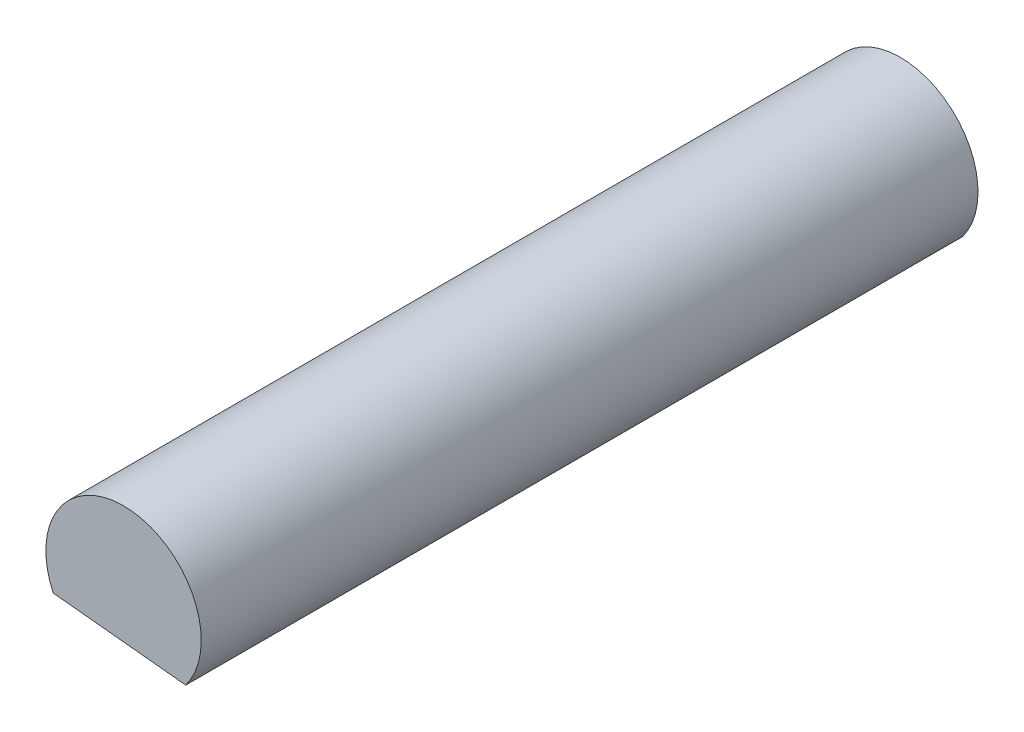
ISO-10303-21;
HEADER;
FILE_DESCRIPTION(('STEP AP214'),'2;1');
FILE_NAME('part.step','',(''),(''),'','','');
FILE_SCHEMA(('AUTOMOTIVE_DESIGN { 1 0 10303 214 1 1 1 1 }'));
ENDSEC;
DATA;
#1=APPLICATION_CONTEXT('core data for automotive mechanical design processes');
#2=APPLICATION_PROTOCOL_DEFINITION('international standard','automotive_design',2000,#1);
#3=PRODUCT_CONTEXT('',#1,'mechanical');
#4=PRODUCT('Part','Part','',(#3));
#5=PRODUCT_RELATED_PRODUCT_CATEGORY('part','',(#4));
#6=PRODUCT_DEFINITION_FORMATION('','',#4);
#7=PRODUCT_DEFINITION_CONTEXT('part definition',#1,'design');
#8=PRODUCT_DEFINITION('design','',#6,#7);
#9=PRODUCT_DEFINITION_SHAPE('','',#8);
#10=(LENGTH_UNIT() NAMED_UNIT(*) SI_UNIT(.MILLI.,.METRE.));
#11=(NAMED_UNIT(*) PLANE_ANGLE_UNIT() SI_UNIT($,.RADIAN.));
#12=(NAMED_UNIT(*) SI_UNIT($,.STERADIAN.) SOLID_ANGLE_UNIT());
#13=UNCERTAINTY_MEASURE_WITH_UNIT(LENGTH_MEASURE(1.E-05),#10,'distance_accuracy_value','');
#14=(GEOMETRIC_REPRESENTATION_CONTEXT(3) GLOBAL_UNCERTAINTY_ASSIGNED_CONTEXT((#13)) GLOBAL_UNIT_ASSIGNED_CONTEXT((#10,
#11,#12)) REPRESENTATION_CONTEXT('',''));
#15=CARTESIAN_POINT('',(0.,0.,0.));
#16=DIRECTION('',(0.,0.,1.));
#17=DIRECTION('',(1.,0.,0.));
#18=AXIS2_PLACEMENT_3D('',#15,#16,#17);
#19=CARTESIAN_POINT('',(0.,0.,350.));
#20=DIRECTION('',(0.,0.,-1.));
#21=DIRECTION('',(-1.,0.,0.));
#22=AXIS2_PLACEMENT_3D('',#19,#20,#21);
#23=CYLINDRICAL_SURFACE('',#22,35.);
#24=CARTESIAN_POINT('',(0.,0.,0.));
#25=DIRECTION('',(0.,0.,1.));
#26=DIRECTION('',(1.,0.,0.));
#27=AXIS2_PLACEMENT_3D('',#24,#25,#26);
#28=CIRCLE('',#27,35.);
#29=CARTESIAN_POINT('',(28.0198397069875,-20.9735209918299,0.));
#30=VERTEX_POINT('',#29);
#31=CARTESIAN_POINT('',(-31.6716240330095,-14.8965845451799,0.));
#32=VERTEX_POINT('',#31);
#33=EDGE_CURVE('E74',#30,#32,#28,.T.);
#34=ORIENTED_EDGE('',*,*,#33,.T.);
#35=DIRECTION('',(0.,0.,-1.));
#36=VECTOR('',#35,1.);
#37=CARTESIAN_POINT('',(-31.6716240330095,-14.8965845451799,350.));
#38=LINE('',#37,#36);
#39=CARTESIAN_POINT('',(-31.6716240330095,-14.8965845451799,350.));
#40=VERTEX_POINT('',#39);
#41=EDGE_CURVE('E11',#40,#32,#38,.T.);
#42=ORIENTED_EDGE('',*,*,#41,.F.);
#43=CARTESIAN_POINT('',(0.,0.,350.));
#44=DIRECTION('',(0.,0.,1.));
#45=DIRECTION('',(1.,0.,0.));
#46=AXIS2_PLACEMENT_3D('',#43,#44,#45);
#47=CIRCLE('',#46,35.);
#48=CARTESIAN_POINT('',(28.0198397069875,-20.9735209918299,350.));
#49=VERTEX_POINT('',#48);
#50=EDGE_CURVE('E73',#49,#40,#47,.T.);
#51=ORIENTED_EDGE('',*,*,#50,.F.);
#52=DIRECTION('',(0.,0.,-1.));
#53=VECTOR('',#52,1.);
#54=CARTESIAN_POINT('',(28.0198397069875,-20.9735209918299,350.));
#55=LINE('',#54,#53);
#56=EDGE_CURVE('E50',#49,#30,#55,.T.);
#57=ORIENTED_EDGE('',*,*,#56,.T.);
#58=EDGE_LOOP('',(#34,#42,#51,#57));
#59=FACE_BOUND('',#58,.T.);
#60=ADVANCED_FACE('F41',(#59),#23,.T.);
#61=CARTESIAN_POINT('',(28.0198397069875,-20.9735209918299,350.));
#62=DIRECTION('',(0.101282274110833,0.99485772899995,0.));
#63=DIRECTION('',(-0.99485772899995,0.101282274110833,0.));
#64=AXIS2_PLACEMENT_3D('',#61,#62,#63);
#65=PLANE('',#64);
#66=DIRECTION('',(0.99485772899995,-0.101282274110833,0.));
#67=VECTOR('',#66,1.);
#68=CARTESIAN_POINT('',(28.0198397069875,-20.9735209918299,0.));
#69=LINE('',#68,#67);
#70=EDGE_CURVE('E65',#32,#30,#69,.T.);
#71=ORIENTED_EDGE('',*,*,#70,.T.);
#72=ORIENTED_EDGE('',*,*,#56,.F.);
#73=DIRECTION('',(0.99485772899995,-0.101282274110833,0.));
#74=VECTOR('',#73,1.);
#75=CARTESIAN_POINT('',(28.0198397069875,-20.9735209918299,350.));
#76=LINE('',#75,#74);
#77=EDGE_CURVE('E57',#40,#49,#76,.T.);
#78=ORIENTED_EDGE('',*,*,#77,.F.);
#79=ORIENTED_EDGE('',*,*,#41,.T.);
#80=EDGE_LOOP('',(#71,#72,#78,#79));
#81=FACE_BOUND('',#80,.T.);
#82=ADVANCED_FACE('F68',(#81),#65,.F.);
#83=CARTESIAN_POINT('',(0.,0.,350.));
#84=DIRECTION('',(0.,0.,1.));
#85=DIRECTION('',(1.,0.,0.));
#86=AXIS2_PLACEMENT_3D('',#83,#84,#85);
#87=PLANE('',#86);
#88=ORIENTED_EDGE('',*,*,#50,.T.);
#89=ORIENTED_EDGE('',*,*,#77,.T.);
#90=EDGE_LOOP('',(#88,#89));
#91=FACE_BOUND('',#90,.T.);
#92=ADVANCED_FACE('F85',(#91),#87,.T.);
#93=CARTESIAN_POINT('',(0.,0.,0.));
#94=DIRECTION('',(0.,0.,1.));
#95=DIRECTION('',(1.,0.,0.));
#96=AXIS2_PLACEMENT_3D('',#93,#94,#95);
#97=PLANE('',#96);
#98=ORIENTED_EDGE('',*,*,#33,.F.);
#99=ORIENTED_EDGE('',*,*,#70,.F.);
#100=EDGE_LOOP('',(#98,#99));
#101=FACE_BOUND('',#100,.T.);
#102=ADVANCED_FACE('F78',(#101),#97,.F.);
#103=CLOSED_SHELL('',(#60,#82,#92,#102));
#104=MANIFOLD_SOLID_BREP('B2',#103);
#105=ADVANCED_BREP_SHAPE_REPRESENTATION('',(#18,#104),#14);
#106=SHAPE_DEFINITION_REPRESENTATION(#9,#105);
ENDSEC;
END-ISO-10303-21;
